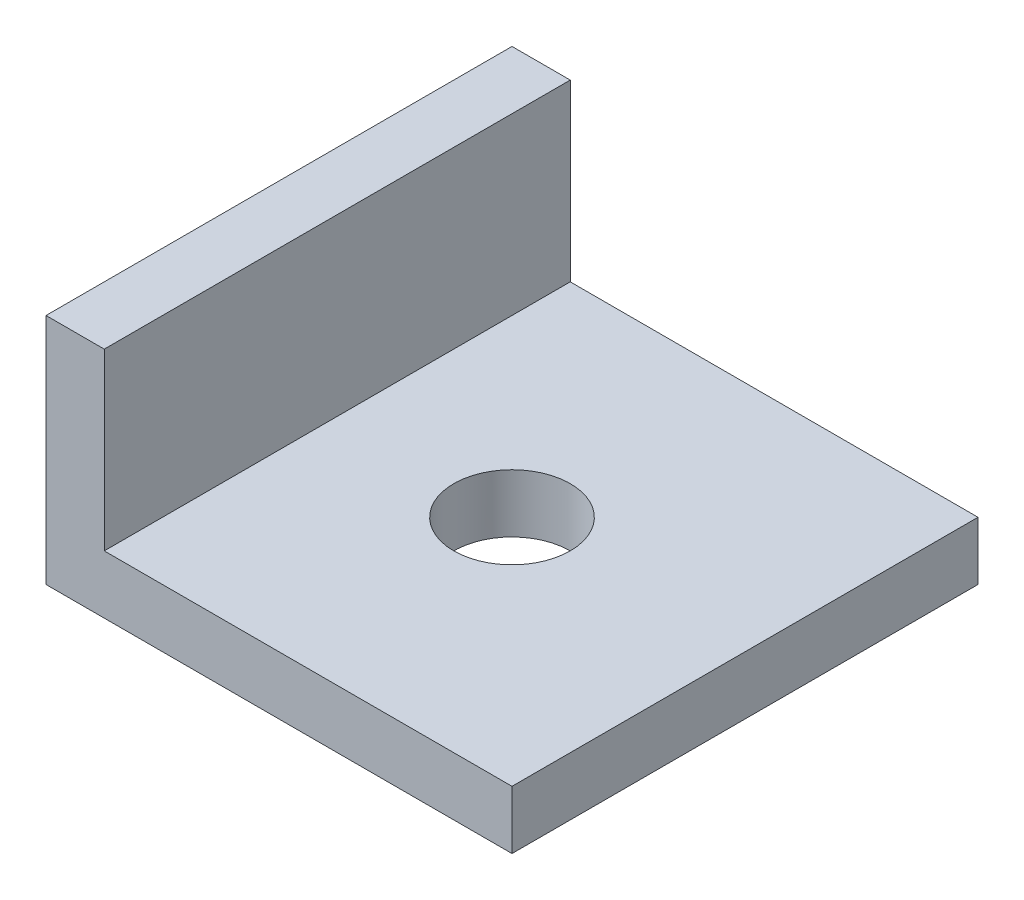
ISO-10303-21;
HEADER;
FILE_DESCRIPTION(('STEP AP214'),'2;1');
FILE_NAME('part.step','',(''),(''),'','','');
FILE_SCHEMA(('AUTOMOTIVE_DESIGN { 1 0 10303 214 1 1 1 1 }'));
ENDSEC;
DATA;
#1=APPLICATION_CONTEXT('core data for automotive mechanical design processes');
#2=APPLICATION_PROTOCOL_DEFINITION('international standard','automotive_design',2000,#1);
#3=PRODUCT_CONTEXT('',#1,'mechanical');
#4=PRODUCT('Part','Part','',(#3));
#5=PRODUCT_RELATED_PRODUCT_CATEGORY('part','',(#4));
#6=PRODUCT_DEFINITION_FORMATION('','',#4);
#7=PRODUCT_DEFINITION_CONTEXT('part definition',#1,'design');
#8=PRODUCT_DEFINITION('design','',#6,#7);
#9=PRODUCT_DEFINITION_SHAPE('','',#8);
#10=(LENGTH_UNIT() NAMED_UNIT(*) SI_UNIT(.MILLI.,.METRE.));
#11=(NAMED_UNIT(*) PLANE_ANGLE_UNIT() SI_UNIT($,.RADIAN.));
#12=(NAMED_UNIT(*) SI_UNIT($,.STERADIAN.) SOLID_ANGLE_UNIT());
#13=UNCERTAINTY_MEASURE_WITH_UNIT(LENGTH_MEASURE(1.E-05),#10,'distance_accuracy_value','');
#14=(GEOMETRIC_REPRESENTATION_CONTEXT(3) GLOBAL_UNCERTAINTY_ASSIGNED_CONTEXT((#13)) GLOBAL_UNIT_ASSIGNED_CONTEXT((#10,
#11,#12)) REPRESENTATION_CONTEXT('',''));
#15=CARTESIAN_POINT('',(0.,0.,0.));
#16=DIRECTION('',(0.,0.,1.));
#17=DIRECTION('',(1.,0.,0.));
#18=AXIS2_PLACEMENT_3D('',#15,#16,#17);
#19=CARTESIAN_POINT('',(50.8,6.34999999999991,-25.4));
#20=DIRECTION('',(0.,1.,0.));
#21=DIRECTION('',(0.,0.,1.));
#22=AXIS2_PLACEMENT_3D('',#19,#20,#21);
#23=PLANE('',#22);
#24=CARTESIAN_POINT('',(25.4,6.34999999999991,0.));
#25=DIRECTION('',(0.,1.,0.));
#26=DIRECTION('',(0.,0.,1.));
#27=AXIS2_PLACEMENT_3D('',#24,#25,#26);
#28=CIRCLE('',#27,6.35);
#29=CARTESIAN_POINT('',(25.4,6.34999999999991,6.35));
#30=VERTEX_POINT('',#29);
#31=EDGE_CURVE('E102',#30,#30,#28,.T.);
#32=ORIENTED_EDGE('',*,*,#31,.F.);
#33=EDGE_LOOP('',(#32));
#34=FACE_BOUND('',#33,.T.);
#35=DIRECTION('',(0.,0.,1.));
#36=VECTOR('',#35,1.);
#37=CARTESIAN_POINT('',(6.34999999999986,6.34999999999991,-25.4));
#38=LINE('',#37,#36);
#39=CARTESIAN_POINT('',(6.34999999999986,6.34999999999991,-25.4));
#40=VERTEX_POINT('',#39);
#41=CARTESIAN_POINT('',(6.34999999999986,6.34999999999991,25.4));
#42=VERTEX_POINT('',#41);
#43=EDGE_CURVE('E119',#40,#42,#38,.T.);
#44=ORIENTED_EDGE('',*,*,#43,.T.);
#45=DIRECTION('',(-1.,0.,0.));
#46=VECTOR('',#45,1.);
#47=CARTESIAN_POINT('',(50.8,6.34999999999991,25.4));
#48=LINE('',#47,#46);
#49=CARTESIAN_POINT('',(50.8,6.34999999999991,25.4));
#50=VERTEX_POINT('',#49);
#51=EDGE_CURVE('E127',#50,#42,#48,.T.);
#52=ORIENTED_EDGE('',*,*,#51,.F.);
#53=DIRECTION('',(0.,0.,1.));
#54=VECTOR('',#53,1.);
#55=CARTESIAN_POINT('',(50.8,6.34999999999991,-25.4));
#56=LINE('',#55,#54);
#57=CARTESIAN_POINT('',(50.8,6.34999999999991,-25.4));
#58=VERTEX_POINT('',#57);
#59=EDGE_CURVE('E44',#58,#50,#56,.T.);
#60=ORIENTED_EDGE('',*,*,#59,.F.);
#61=DIRECTION('',(-1.,0.,0.));
#62=VECTOR('',#61,1.);
#63=CARTESIAN_POINT('',(50.8,6.34999999999991,-25.4));
#64=LINE('',#63,#62);
#65=EDGE_CURVE('E113',#58,#40,#64,.T.);
#66=ORIENTED_EDGE('',*,*,#65,.T.);
#67=EDGE_LOOP('',(#44,#52,#60,#66));
#68=FACE_BOUND('',#67,.T.);
#69=ADVANCED_FACE('F36',(#34,#68),#23,.T.);
#70=CARTESIAN_POINT('',(50.8,0.,-25.4));
#71=DIRECTION('',(1.,0.,0.));
#72=DIRECTION('',(0.,0.,-1.));
#73=AXIS2_PLACEMENT_3D('',#70,#71,#72);
#74=PLANE('',#73);
#75=ORIENTED_EDGE('',*,*,#59,.T.);
#76=DIRECTION('',(0.,1.,0.));
#77=VECTOR('',#76,1.);
#78=CARTESIAN_POINT('',(50.8,0.,25.4));
#79=LINE('',#78,#77);
#80=CARTESIAN_POINT('',(50.8,0.,25.4));
#81=VERTEX_POINT('',#80);
#82=EDGE_CURVE('E138',#81,#50,#79,.T.);
#83=ORIENTED_EDGE('',*,*,#82,.F.);
#84=DIRECTION('',(0.,0.,1.));
#85=VECTOR('',#84,1.);
#86=CARTESIAN_POINT('',(50.8,0.,-25.4));
#87=LINE('',#86,#85);
#88=CARTESIAN_POINT('',(50.8,0.,-25.4));
#89=VERTEX_POINT('',#88);
#90=EDGE_CURVE('E121',#89,#81,#87,.T.);
#91=ORIENTED_EDGE('',*,*,#90,.F.);
#92=DIRECTION('',(0.,1.,0.));
#93=VECTOR('',#92,1.);
#94=CARTESIAN_POINT('',(50.8,0.,-25.4));
#95=LINE('',#94,#93);
#96=EDGE_CURVE('E111',#89,#58,#95,.T.);
#97=ORIENTED_EDGE('',*,*,#96,.T.);
#98=EDGE_LOOP('',(#75,#83,#91,#97));
#99=FACE_BOUND('',#98,.T.);
#100=ADVANCED_FACE('F148',(#99),#74,.T.);
#101=CARTESIAN_POINT('',(0.,0.,-25.4));
#102=DIRECTION('',(0.,-1.,0.));
#103=DIRECTION('',(1.,0.,0.));
#104=AXIS2_PLACEMENT_3D('',#101,#102,#103);
#105=PLANE('',#104);
#106=CARTESIAN_POINT('',(25.4,0.,0.));
#107=DIRECTION('',(0.,-1.,0.));
#108=DIRECTION('',(1.,0.,0.));
#109=AXIS2_PLACEMENT_3D('',#106,#107,#108);
#110=CIRCLE('',#109,6.35);
#111=CARTESIAN_POINT('',(31.75,0.,0.));
#112=VERTEX_POINT('',#111);
#113=EDGE_CURVE('E39',#112,#112,#110,.T.);
#114=ORIENTED_EDGE('',*,*,#113,.F.);
#115=EDGE_LOOP('',(#114));
#116=FACE_BOUND('',#115,.T.);
#117=ORIENTED_EDGE('',*,*,#90,.T.);
#118=DIRECTION('',(1.,0.,0.));
#119=VECTOR('',#118,1.);
#120=CARTESIAN_POINT('',(0.,0.,25.4));
#121=LINE('',#120,#119);
#122=CARTESIAN_POINT('',(0.,0.,25.4));
#123=VERTEX_POINT('',#122);
#124=EDGE_CURVE('E143',#123,#81,#121,.T.);
#125=ORIENTED_EDGE('',*,*,#124,.F.);
#126=DIRECTION('',(0.,0.,1.));
#127=VECTOR('',#126,1.);
#128=CARTESIAN_POINT('',(0.,0.,-25.4));
#129=LINE('',#128,#127);
#130=CARTESIAN_POINT('',(0.,0.,-25.4));
#131=VERTEX_POINT('',#130);
#132=EDGE_CURVE('E123',#131,#123,#129,.T.);
#133=ORIENTED_EDGE('',*,*,#132,.F.);
#134=DIRECTION('',(1.,0.,0.));
#135=VECTOR('',#134,1.);
#136=CARTESIAN_POINT('',(0.,0.,-25.4));
#137=LINE('',#136,#135);
#138=EDGE_CURVE('E108',#131,#89,#137,.T.);
#139=ORIENTED_EDGE('',*,*,#138,.T.);
#140=EDGE_LOOP('',(#117,#125,#133,#139));
#141=FACE_BOUND('',#140,.T.);
#142=ADVANCED_FACE('F149',(#116,#141),#105,.T.);
#143=CARTESIAN_POINT('',(0.,0.,-25.4));
#144=DIRECTION('',(-1.,0.,0.));
#145=DIRECTION('',(0.,-1.,0.));
#146=AXIS2_PLACEMENT_3D('',#143,#144,#145);
#147=PLANE('',#146);
#148=DIRECTION('',(0.,0.,1.));
#149=VECTOR('',#148,1.);
#150=CARTESIAN_POINT('',(0.,25.4,-25.4));
#151=LINE('',#150,#149);
#152=CARTESIAN_POINT('',(0.,25.4,-25.4));
#153=VERTEX_POINT('',#152);
#154=CARTESIAN_POINT('',(0.,25.4,25.4));
#155=VERTEX_POINT('',#154);
#156=EDGE_CURVE('E51',#153,#155,#151,.T.);
#157=ORIENTED_EDGE('',*,*,#156,.F.);
#158=DIRECTION('',(0.,-1.,0.));
#159=VECTOR('',#158,1.);
#160=CARTESIAN_POINT('',(0.,0.,-25.4));
#161=LINE('',#160,#159);
#162=EDGE_CURVE('E99',#153,#131,#161,.T.);
#163=ORIENTED_EDGE('',*,*,#162,.T.);
#164=ORIENTED_EDGE('',*,*,#132,.T.);
#165=DIRECTION('',(0.,-1.,0.));
#166=VECTOR('',#165,1.);
#167=CARTESIAN_POINT('',(0.,0.,25.4));
#168=LINE('',#167,#166);
#169=EDGE_CURVE('E101',#155,#123,#168,.T.);
#170=ORIENTED_EDGE('',*,*,#169,.F.);
#171=EDGE_LOOP('',(#157,#163,#164,#170));
#172=FACE_BOUND('',#171,.T.);
#173=ADVANCED_FACE('F97',(#172),#147,.T.);
#174=CARTESIAN_POINT('',(6.34999999999986,6.34999999999991,-25.4));
#175=DIRECTION('',(1.,0.,0.));
#176=DIRECTION('',(0.,0.,-1.));
#177=AXIS2_PLACEMENT_3D('',#174,#175,#176);
#178=PLANE('',#177);
#179=DIRECTION('',(0.,0.,-1.));
#180=VECTOR('',#179,1.);
#181=CARTESIAN_POINT('',(6.34999999999986,25.4,-25.4));
#182=LINE('',#181,#180);
#183=CARTESIAN_POINT('',(6.34999999999987,25.4,25.4));
#184=VERTEX_POINT('',#183);
#185=CARTESIAN_POINT('',(6.34999999999987,25.4,-25.4));
#186=VERTEX_POINT('',#185);
#187=EDGE_CURVE('E89',#184,#186,#182,.T.);
#188=ORIENTED_EDGE('',*,*,#187,.F.);
#189=DIRECTION('',(0.,1.,0.));
#190=VECTOR('',#189,1.);
#191=CARTESIAN_POINT('',(6.34999999999986,6.34999999999991,25.4));
#192=LINE('',#191,#190);
#193=EDGE_CURVE('E130',#42,#184,#192,.T.);
#194=ORIENTED_EDGE('',*,*,#193,.F.);
#195=ORIENTED_EDGE('',*,*,#43,.F.);
#196=DIRECTION('',(0.,1.,0.));
#197=VECTOR('',#196,1.);
#198=CARTESIAN_POINT('',(6.34999999999986,6.34999999999991,-25.4));
#199=LINE('',#198,#197);
#200=EDGE_CURVE('E109',#40,#186,#199,.T.);
#201=ORIENTED_EDGE('',*,*,#200,.T.);
#202=EDGE_LOOP('',(#188,#194,#195,#201));
#203=FACE_BOUND('',#202,.T.);
#204=ADVANCED_FACE('F131',(#203),#178,.T.);
#205=CARTESIAN_POINT('',(0.,0.,-25.4));
#206=DIRECTION('',(0.,0.,-1.));
#207=DIRECTION('',(-1.,0.,0.));
#208=AXIS2_PLACEMENT_3D('',#205,#206,#207);
#209=PLANE('',#208);
#210=DIRECTION('',(-1.,0.,0.));
#211=VECTOR('',#210,1.);
#212=CARTESIAN_POINT('',(50.8000000000001,25.4000000000001,-25.4));
#213=LINE('',#212,#211);
#214=EDGE_CURVE('E86',#186,#153,#213,.T.);
#215=ORIENTED_EDGE('',*,*,#214,.F.);
#216=ORIENTED_EDGE('',*,*,#200,.F.);
#217=ORIENTED_EDGE('',*,*,#65,.F.);
#218=ORIENTED_EDGE('',*,*,#96,.F.);
#219=ORIENTED_EDGE('',*,*,#138,.F.);
#220=ORIENTED_EDGE('',*,*,#162,.F.);
#221=EDGE_LOOP('',(#215,#216,#217,#218,#219,#220));
#222=FACE_BOUND('',#221,.T.);
#223=ADVANCED_FACE('F105',(#222),#209,.T.);
#224=CARTESIAN_POINT('',(0.,0.,25.4));
#225=DIRECTION('',(0.,0.,-1.));
#226=DIRECTION('',(-1.,0.,0.));
#227=AXIS2_PLACEMENT_3D('',#224,#225,#226);
#228=PLANE('',#227);
#229=ORIENTED_EDGE('',*,*,#193,.T.);
#230=DIRECTION('',(-1.,0.,0.));
#231=VECTOR('',#230,1.);
#232=CARTESIAN_POINT('',(0.,25.4,25.4));
#233=LINE('',#232,#231);
#234=EDGE_CURVE('E11',#184,#155,#233,.T.);
#235=ORIENTED_EDGE('',*,*,#234,.T.);
#236=ORIENTED_EDGE('',*,*,#169,.T.);
#237=ORIENTED_EDGE('',*,*,#124,.T.);
#238=ORIENTED_EDGE('',*,*,#82,.T.);
#239=ORIENTED_EDGE('',*,*,#51,.T.);
#240=EDGE_LOOP('',(#229,#235,#236,#237,#238,#239));
#241=FACE_BOUND('',#240,.T.);
#242=ADVANCED_FACE('F135',(#241),#228,.F.);
#243=CARTESIAN_POINT('',(50.8000000000001,25.4000000000001,-25.4));
#244=DIRECTION('',(0.,-1.,0.));
#245=DIRECTION('',(1.,0.,0.));
#246=AXIS2_PLACEMENT_3D('',#243,#244,#245);
#247=PLANE('',#246);
#248=ORIENTED_EDGE('',*,*,#187,.T.);
#249=ORIENTED_EDGE('',*,*,#214,.T.);
#250=ORIENTED_EDGE('',*,*,#156,.T.);
#251=ORIENTED_EDGE('',*,*,#234,.F.);
#252=EDGE_LOOP('',(#248,#249,#250,#251));
#253=FACE_BOUND('',#252,.T.);
#254=ADVANCED_FACE('F87',(#253),#247,.F.);
#255=CARTESIAN_POINT('',(25.4,25.4000000000001,0.));
#256=DIRECTION('',(0.,-1.,0.));
#257=DIRECTION('',(1.,0.,0.));
#258=AXIS2_PLACEMENT_3D('',#255,#256,#257);
#259=CYLINDRICAL_SURFACE('',#258,6.35);
#260=ORIENTED_EDGE('',*,*,#31,.T.);
#261=EDGE_LOOP('',(#260));
#262=FACE_BOUND('',#261,.T.);
#263=ORIENTED_EDGE('',*,*,#113,.T.);
#264=EDGE_LOOP('',(#263));
#265=FACE_BOUND('',#264,.T.);
#266=ADVANCED_FACE('F170',(#262,#265),#259,.F.);
#267=CLOSED_SHELL('',(#69,#100,#142,#173,#204,#223,#242,#254,#266));
#268=MANIFOLD_SOLID_BREP('B2',#267);
#269=ADVANCED_BREP_SHAPE_REPRESENTATION('',(#18,#268),#14);
#270=SHAPE_DEFINITION_REPRESENTATION(#9,#269);
ENDSEC;
END-ISO-10303-21;
